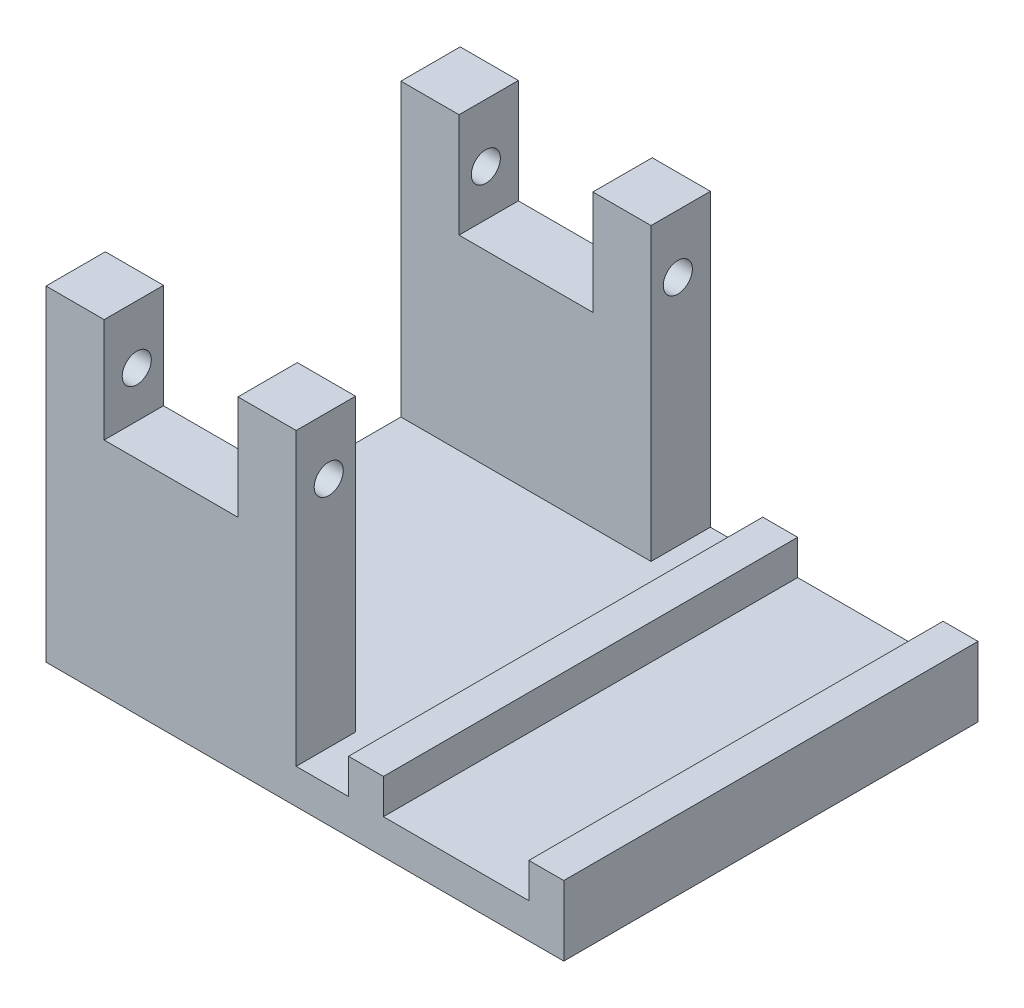
ISO-10303-21;
HEADER;
FILE_DESCRIPTION(('STEP AP214'),'2;1');
FILE_NAME('part.step','',(''),(''),'','','');
FILE_SCHEMA(('AUTOMOTIVE_DESIGN { 1 0 10303 214 1 1 1 1 }'));
ENDSEC;
DATA;
#1=APPLICATION_CONTEXT('core data for automotive mechanical design processes');
#2=APPLICATION_PROTOCOL_DEFINITION('international standard','automotive_design',2000,#1);
#3=PRODUCT_CONTEXT('',#1,'mechanical');
#4=PRODUCT('Part','Part','',(#3));
#5=PRODUCT_RELATED_PRODUCT_CATEGORY('part','',(#4));
#6=PRODUCT_DEFINITION_FORMATION('','',#4);
#7=PRODUCT_DEFINITION_CONTEXT('part definition',#1,'design');
#8=PRODUCT_DEFINITION('design','',#6,#7);
#9=PRODUCT_DEFINITION_SHAPE('','',#8);
#10=(LENGTH_UNIT() NAMED_UNIT(*) SI_UNIT(.MILLI.,.METRE.));
#11=(NAMED_UNIT(*) PLANE_ANGLE_UNIT() SI_UNIT($,.RADIAN.));
#12=(NAMED_UNIT(*) SI_UNIT($,.STERADIAN.) SOLID_ANGLE_UNIT());
#13=UNCERTAINTY_MEASURE_WITH_UNIT(LENGTH_MEASURE(1.E-05),#10,'distance_accuracy_value','');
#14=(GEOMETRIC_REPRESENTATION_CONTEXT(3) GLOBAL_UNCERTAINTY_ASSIGNED_CONTEXT((#13)) GLOBAL_UNIT_ASSIGNED_CONTEXT((#10,
#11,#12)) REPRESENTATION_CONTEXT('',''));
#15=CARTESIAN_POINT('',(0.,0.,0.));
#16=DIRECTION('',(0.,0.,1.));
#17=DIRECTION('',(1.,0.,0.));
#18=AXIS2_PLACEMENT_3D('',#15,#16,#17);
#19=CARTESIAN_POINT('',(0.,3.,0.));
#20=DIRECTION('',(0.,-1.,0.));
#21=DIRECTION('',(0.,0.,-1.));
#22=AXIS2_PLACEMENT_3D('',#19,#20,#21);
#23=PLANE('',#22);
#24=DIRECTION('',(1.,0.,0.));
#25=VECTOR('',#24,1.);
#26=CARTESIAN_POINT('',(-10.75,3.,-12.7));
#27=LINE('',#26,#25);
#28=CARTESIAN_POINT('',(-10.75,3.,-12.7));
#29=VERTEX_POINT('',#28);
#30=CARTESIAN_POINT('',(10.75,3.,-12.7));
#31=VERTEX_POINT('',#30);
#32=EDGE_CURVE('E318',#29,#31,#27,.T.);
#33=ORIENTED_EDGE('',*,*,#32,.F.);
#34=DIRECTION('',(0.,0.,1.));
#35=VECTOR('',#34,1.);
#36=CARTESIAN_POINT('',(-10.75,3.,0.));
#37=LINE('',#36,#35);
#38=CARTESIAN_POINT('',(-10.75,3.,12.7));
#39=VERTEX_POINT('',#38);
#40=EDGE_CURVE('E229',#29,#39,#37,.T.);
#41=ORIENTED_EDGE('',*,*,#40,.T.);
#42=DIRECTION('',(-1.,0.,0.));
#43=VECTOR('',#42,1.);
#44=CARTESIAN_POINT('',(-10.75,3.,12.7));
#45=LINE('',#44,#43);
#46=CARTESIAN_POINT('',(10.75,3.,12.7));
#47=VERTEX_POINT('',#46);
#48=EDGE_CURVE('E309',#47,#39,#45,.T.);
#49=ORIENTED_EDGE('',*,*,#48,.F.);
#50=DIRECTION('',(0.,0.,-1.));
#51=VECTOR('',#50,1.);
#52=CARTESIAN_POINT('',(10.75,3.,17.8));
#53=LINE('',#52,#51);
#54=CARTESIAN_POINT('',(10.75,3.,17.8));
#55=VERTEX_POINT('',#54);
#56=EDGE_CURVE('E313',#55,#47,#53,.T.);
#57=ORIENTED_EDGE('',*,*,#56,.F.);
#58=DIRECTION('',(-1.,0.,0.));
#59=VECTOR('',#58,1.);
#60=CARTESIAN_POINT('',(30.75,3.,17.8));
#61=LINE('',#60,#59);
#62=CARTESIAN_POINT('',(15.25,3.,17.8));
#63=VERTEX_POINT('',#62);
#64=EDGE_CURVE('E404',#63,#55,#61,.T.);
#65=ORIENTED_EDGE('',*,*,#64,.F.);
#66=DIRECTION('',(0.,0.,1.));
#67=VECTOR('',#66,1.);
#68=CARTESIAN_POINT('',(15.25,3.,-17.8));
#69=LINE('',#68,#67);
#70=CARTESIAN_POINT('',(15.25,3.,-17.8));
#71=VERTEX_POINT('',#70);
#72=EDGE_CURVE('E69',#71,#63,#69,.T.);
#73=ORIENTED_EDGE('',*,*,#72,.F.);
#74=DIRECTION('',(-1.,0.,0.));
#75=VECTOR('',#74,1.);
#76=CARTESIAN_POINT('',(-18.25,3.,-17.8));
#77=LINE('',#76,#75);
#78=CARTESIAN_POINT('',(10.75,3.,-17.8));
#79=VERTEX_POINT('',#78);
#80=EDGE_CURVE('E236',#71,#79,#77,.T.);
#81=ORIENTED_EDGE('',*,*,#80,.T.);
#82=DIRECTION('',(0.,0.,-1.));
#83=VECTOR('',#82,1.);
#84=CARTESIAN_POINT('',(10.75,3.,-17.8));
#85=LINE('',#84,#83);
#86=EDGE_CURVE('E336',#31,#79,#85,.T.);
#87=ORIENTED_EDGE('',*,*,#86,.F.);
#88=EDGE_LOOP('',(#33,#41,#49,#57,#65,#73,#81,#87));
#89=FACE_BOUND('',#88,.T.);
#90=ADVANCED_FACE('F45',(#89),#23,.F.);
#91=DIRECTION('',(0.,0.,-1.));
#92=VECTOR('',#91,1.);
#93=CARTESIAN_POINT('',(18.25,3.,-17.8));
#94=LINE('',#93,#92);
#95=CARTESIAN_POINT('',(18.25,3.,17.8));
#96=VERTEX_POINT('',#95);
#97=CARTESIAN_POINT('',(18.25,3.,-17.8));
#98=VERTEX_POINT('',#97);
#99=EDGE_CURVE('E414',#96,#98,#94,.T.);
#100=ORIENTED_EDGE('',*,*,#99,.F.);
#101=CARTESIAN_POINT('',(30.75,3.,17.8));
#102=VERTEX_POINT('',#101);
#103=EDGE_CURVE('E242',#102,#96,#61,.T.);
#104=ORIENTED_EDGE('',*,*,#103,.F.);
#105=DIRECTION('',(0.,0.,1.));
#106=VECTOR('',#105,1.);
#107=CARTESIAN_POINT('',(30.75,3.,17.8));
#108=LINE('',#107,#106);
#109=CARTESIAN_POINT('',(30.75,3.,-17.8));
#110=VERTEX_POINT('',#109);
#111=EDGE_CURVE('E390',#110,#102,#108,.T.);
#112=ORIENTED_EDGE('',*,*,#111,.F.);
#113=EDGE_CURVE('E54',#110,#98,#77,.T.);
#114=ORIENTED_EDGE('',*,*,#113,.T.);
#115=EDGE_LOOP('',(#100,#104,#112,#114));
#116=FACE_BOUND('',#115,.T.);
#117=ADVANCED_FACE('F412',(#116),#23,.F.);
#118=CARTESIAN_POINT('',(0.,28.,0.));
#119=DIRECTION('',(0.,1.,0.));
#120=DIRECTION('',(0.,0.,1.));
#121=AXIS2_PLACEMENT_3D('',#118,#119,#120);
#122=PLANE('',#121);
#123=DIRECTION('',(0.,0.,-1.));
#124=VECTOR('',#123,1.);
#125=CARTESIAN_POINT('',(5.75,28.,17.8));
#126=LINE('',#125,#124);
#127=CARTESIAN_POINT('',(5.75,28.,-12.7));
#128=VERTEX_POINT('',#127);
#129=CARTESIAN_POINT('',(5.75,28.,-17.8));
#130=VERTEX_POINT('',#129);
#131=EDGE_CURVE('E478',#128,#130,#126,.T.);
#132=ORIENTED_EDGE('',*,*,#131,.F.);
#133=DIRECTION('',(1.,0.,0.));
#134=VECTOR('',#133,1.);
#135=CARTESIAN_POINT('',(-10.75,28.,-12.7));
#136=LINE('',#135,#134);
#137=CARTESIAN_POINT('',(10.75,28.,-12.7));
#138=VERTEX_POINT('',#137);
#139=EDGE_CURVE('E335',#128,#138,#136,.T.);
#140=ORIENTED_EDGE('',*,*,#139,.T.);
#141=DIRECTION('',(0.,0.,-1.));
#142=VECTOR('',#141,1.);
#143=CARTESIAN_POINT('',(10.75,28.,-17.8));
#144=LINE('',#143,#142);
#145=CARTESIAN_POINT('',(10.75,28.,-17.8));
#146=VERTEX_POINT('',#145);
#147=EDGE_CURVE('E340',#138,#146,#144,.T.);
#148=ORIENTED_EDGE('',*,*,#147,.T.);
#149=DIRECTION('',(-1.,0.,0.));
#150=VECTOR('',#149,1.);
#151=CARTESIAN_POINT('',(-10.75,28.,-17.8));
#152=LINE('',#151,#150);
#153=EDGE_CURVE('E344',#146,#130,#152,.T.);
#154=ORIENTED_EDGE('',*,*,#153,.T.);
#155=EDGE_LOOP('',(#132,#140,#148,#154));
#156=FACE_BOUND('',#155,.T.);
#157=ADVANCED_FACE('F557',(#156),#122,.T.);
#158=CARTESIAN_POINT('',(0.,28.,0.));
#159=DIRECTION('',(0.,-1.,0.));
#160=DIRECTION('',(0.,0.,-1.));
#161=AXIS2_PLACEMENT_3D('',#158,#159,#160);
#162=PLANE('',#161);
#163=DIRECTION('',(-1.,0.,0.));
#164=VECTOR('',#163,1.);
#165=CARTESIAN_POINT('',(-10.75,28.,12.7));
#166=LINE('',#165,#164);
#167=CARTESIAN_POINT('',(10.75,28.,12.7));
#168=VERTEX_POINT('',#167);
#169=CARTESIAN_POINT('',(5.75,28.,12.7));
#170=VERTEX_POINT('',#169);
#171=EDGE_CURVE('E319',#168,#170,#166,.T.);
#172=ORIENTED_EDGE('',*,*,#171,.T.);
#173=CARTESIAN_POINT('',(5.75,28.,17.8));
#174=VERTEX_POINT('',#173);
#175=EDGE_CURVE('E249',#174,#170,#126,.T.);
#176=ORIENTED_EDGE('',*,*,#175,.F.);
#177=DIRECTION('',(1.,0.,0.));
#178=VECTOR('',#177,1.);
#179=CARTESIAN_POINT('',(-10.75,28.,17.8));
#180=LINE('',#179,#178);
#181=CARTESIAN_POINT('',(10.75,28.,17.8));
#182=VERTEX_POINT('',#181);
#183=EDGE_CURVE('E326',#174,#182,#180,.T.);
#184=ORIENTED_EDGE('',*,*,#183,.T.);
#185=DIRECTION('',(0.,0.,-1.));
#186=VECTOR('',#185,1.);
#187=CARTESIAN_POINT('',(10.75,28.,17.8));
#188=LINE('',#187,#186);
#189=EDGE_CURVE('E323',#182,#168,#188,.T.);
#190=ORIENTED_EDGE('',*,*,#189,.T.);
#191=EDGE_LOOP('',(#172,#176,#184,#190));
#192=FACE_BOUND('',#191,.T.);
#193=ADVANCED_FACE('F535',(#192),#162,.F.);
#194=CARTESIAN_POINT('',(-33.75,23.,15.));
#195=DIRECTION('',(1.,0.,0.));
#196=DIRECTION('',(0.,0.,-1.));
#197=AXIS2_PLACEMENT_3D('',#194,#195,#196);
#198=CYLINDRICAL_SURFACE('',#197,1.25);
#199=CARTESIAN_POINT('',(5.75,23.,15.));
#200=DIRECTION('',(1.,0.,0.));
#201=DIRECTION('',(0.,1.,0.));
#202=AXIS2_PLACEMENT_3D('',#199,#200,#201);
#203=CIRCLE('',#202,1.25);
#204=CARTESIAN_POINT('',(5.75,24.25,15.));
#205=VERTEX_POINT('',#204);
#206=EDGE_CURVE('E253',#205,#205,#203,.F.);
#207=ORIENTED_EDGE('',*,*,#206,.T.);
#208=EDGE_LOOP('',(#207));
#209=FACE_BOUND('',#208,.T.);
#210=CARTESIAN_POINT('',(10.75,23.,15.));
#211=DIRECTION('',(1.,0.,0.));
#212=DIRECTION('',(0.,0.,1.));
#213=AXIS2_PLACEMENT_3D('',#210,#211,#212);
#214=CIRCLE('',#213,1.25);
#215=CARTESIAN_POINT('',(10.75,23.,16.25));
#216=VERTEX_POINT('',#215);
#217=EDGE_CURVE('E283',#216,#216,#214,.T.);
#218=ORIENTED_EDGE('',*,*,#217,.T.);
#219=EDGE_LOOP('',(#218));
#220=FACE_BOUND('',#219,.T.);
#221=ADVANCED_FACE('F570',(#209,#220),#198,.F.);
#222=CARTESIAN_POINT('',(-33.75,23.,-15.));
#223=DIRECTION('',(1.,0.,0.));
#224=DIRECTION('',(0.,0.,-1.));
#225=AXIS2_PLACEMENT_3D('',#222,#223,#224);
#226=CYLINDRICAL_SURFACE('',#225,1.25);
#227=CARTESIAN_POINT('',(5.75,23.,-15.));
#228=DIRECTION('',(1.,0.,0.));
#229=DIRECTION('',(0.,1.,0.));
#230=AXIS2_PLACEMENT_3D('',#227,#228,#229);
#231=CIRCLE('',#230,1.25);
#232=CARTESIAN_POINT('',(5.75,24.25,-15.));
#233=VERTEX_POINT('',#232);
#234=EDGE_CURVE('E250',#233,#233,#231,.F.);
#235=ORIENTED_EDGE('',*,*,#234,.T.);
#236=EDGE_LOOP('',(#235));
#237=FACE_BOUND('',#236,.T.);
#238=CARTESIAN_POINT('',(10.75,23.,-15.));
#239=DIRECTION('',(1.,0.,0.));
#240=DIRECTION('',(0.,0.,-1.));
#241=AXIS2_PLACEMENT_3D('',#238,#239,#240);
#242=CIRCLE('',#241,1.25);
#243=CARTESIAN_POINT('',(10.75,23.,-16.25));
#244=VERTEX_POINT('',#243);
#245=EDGE_CURVE('E284',#244,#244,#242,.T.);
#246=ORIENTED_EDGE('',*,*,#245,.T.);
#247=EDGE_LOOP('',(#246));
#248=FACE_BOUND('',#247,.T.);
#249=ADVANCED_FACE('F566',(#237,#248),#226,.F.);
#250=CARTESIAN_POINT('',(-18.25,3.,-17.8));
#251=DIRECTION('',(0.,0.,1.));
#252=DIRECTION('',(1.,0.,0.));
#253=AXIS2_PLACEMENT_3D('',#250,#251,#252);
#254=PLANE('',#253);
#255=DIRECTION('',(-1.,0.,0.));
#256=VECTOR('',#255,1.);
#257=CARTESIAN_POINT('',(-18.25,0.,-17.8));
#258=LINE('',#257,#256);
#259=CARTESIAN_POINT('',(33.75,0.,-17.8));
#260=VERTEX_POINT('',#259);
#261=CARTESIAN_POINT('',(-10.75,0.,-17.8));
#262=VERTEX_POINT('',#261);
#263=EDGE_CURVE('E237',#260,#262,#258,.T.);
#264=ORIENTED_EDGE('',*,*,#263,.T.);
#265=DIRECTION('',(0.,-1.,0.));
#266=VECTOR('',#265,1.);
#267=CARTESIAN_POINT('',(-10.75,28.,-17.8));
#268=LINE('',#267,#266);
#269=CARTESIAN_POINT('',(-10.75,28.,-17.8));
#270=VERTEX_POINT('',#269);
#271=EDGE_CURVE('E61',#270,#262,#268,.T.);
#272=ORIENTED_EDGE('',*,*,#271,.F.);
#273=CARTESIAN_POINT('',(-5.75000000000001,28.,-17.8));
#274=VERTEX_POINT('',#273);
#275=EDGE_CURVE('E343',#274,#270,#152,.T.);
#276=ORIENTED_EDGE('',*,*,#275,.F.);
#277=DIRECTION('',(0.,1.,0.));
#278=VECTOR('',#277,1.);
#279=CARTESIAN_POINT('',(-5.75000000000001,28.,-17.8));
#280=LINE('',#279,#278);
#281=CARTESIAN_POINT('',(-5.75000000000001,19.0369423083039,-17.8));
#282=VERTEX_POINT('',#281);
#283=EDGE_CURVE('E458',#282,#274,#280,.T.);
#284=ORIENTED_EDGE('',*,*,#283,.F.);
#285=DIRECTION('',(-1.,0.,0.));
#286=VECTOR('',#285,1.);
#287=CARTESIAN_POINT('',(5.75,19.0369423083039,-17.8));
#288=LINE('',#287,#286);
#289=CARTESIAN_POINT('',(5.75,19.0369423083039,-17.8));
#290=VERTEX_POINT('',#289);
#291=EDGE_CURVE('E470',#290,#282,#288,.T.);
#292=ORIENTED_EDGE('',*,*,#291,.F.);
#293=DIRECTION('',(0.,-1.,0.));
#294=VECTOR('',#293,1.);
#295=CARTESIAN_POINT('',(5.75,28.,-17.8));
#296=LINE('',#295,#294);
#297=EDGE_CURVE('E466',#130,#290,#296,.T.);
#298=ORIENTED_EDGE('',*,*,#297,.F.);
#299=ORIENTED_EDGE('',*,*,#153,.F.);
#300=DIRECTION('',(0.,-1.,0.));
#301=VECTOR('',#300,1.);
#302=CARTESIAN_POINT('',(10.75,28.,-17.8));
#303=LINE('',#302,#301);
#304=EDGE_CURVE('E356',#146,#79,#303,.T.);
#305=ORIENTED_EDGE('',*,*,#304,.T.);
#306=ORIENTED_EDGE('',*,*,#80,.F.);
#307=DIRECTION('',(0.,-1.,0.));
#308=VECTOR('',#307,1.);
#309=CARTESIAN_POINT('',(15.25,41.7261808762146,-17.8));
#310=LINE('',#309,#308);
#311=CARTESIAN_POINT('',(15.25,6.,-17.8));
#312=VERTEX_POINT('',#311);
#313=EDGE_CURVE('E426',#312,#71,#310,.T.);
#314=ORIENTED_EDGE('',*,*,#313,.F.);
#315=DIRECTION('',(1.,0.,0.));
#316=VECTOR('',#315,1.);
#317=CARTESIAN_POINT('',(18.25,6.,-17.8));
#318=LINE('',#317,#316);
#319=CARTESIAN_POINT('',(18.25,6.,-17.8));
#320=VERTEX_POINT('',#319);
#321=EDGE_CURVE('E421',#312,#320,#318,.T.);
#322=ORIENTED_EDGE('',*,*,#321,.T.);
#323=DIRECTION('',(0.,-1.,0.));
#324=VECTOR('',#323,1.);
#325=CARTESIAN_POINT('',(18.25,41.7261808762146,-17.8));
#326=LINE('',#325,#324);
#327=EDGE_CURVE('E419',#320,#98,#326,.T.);
#328=ORIENTED_EDGE('',*,*,#327,.T.);
#329=ORIENTED_EDGE('',*,*,#113,.F.);
#330=DIRECTION('',(0.,-1.,0.));
#331=VECTOR('',#330,1.);
#332=CARTESIAN_POINT('',(30.75,6.,-17.8));
#333=LINE('',#332,#331);
#334=CARTESIAN_POINT('',(30.75,6.,-17.8));
#335=VERTEX_POINT('',#334);
#336=EDGE_CURVE('E383',#335,#110,#333,.T.);
#337=ORIENTED_EDGE('',*,*,#336,.F.);
#338=DIRECTION('',(1.,0.,0.));
#339=VECTOR('',#338,1.);
#340=CARTESIAN_POINT('',(30.75,6.,-17.8));
#341=LINE('',#340,#339);
#342=CARTESIAN_POINT('',(33.75,6.,-17.8));
#343=VERTEX_POINT('',#342);
#344=EDGE_CURVE('E371',#335,#343,#341,.T.);
#345=ORIENTED_EDGE('',*,*,#344,.T.);
#346=DIRECTION('',(0.,-1.,0.));
#347=VECTOR('',#346,1.);
#348=CARTESIAN_POINT('',(33.75,6.,-17.8));
#349=LINE('',#348,#347);
#350=EDGE_CURVE('E394',#343,#260,#349,.T.);
#351=ORIENTED_EDGE('',*,*,#350,.T.);
#352=EDGE_LOOP('',(#264,#272,#276,#284,#292,#298,#299,#305,#306,#314,#322,#328,#329,#337,#345,#351));
#353=FACE_BOUND('',#352,.T.);
#354=ADVANCED_FACE('F47',(#353),#254,.F.);
#355=CARTESIAN_POINT('',(-18.25,3.,17.8));
#356=DIRECTION('',(0.,0.,-1.));
#357=DIRECTION('',(-1.,0.,0.));
#358=AXIS2_PLACEMENT_3D('',#355,#356,#357);
#359=PLANE('',#358);
#360=DIRECTION('',(0.,-1.,0.));
#361=VECTOR('',#360,1.);
#362=CARTESIAN_POINT('',(-10.75,28.,17.8));
#363=LINE('',#362,#361);
#364=CARTESIAN_POINT('',(-10.75,28.,17.8));
#365=VERTEX_POINT('',#364);
#366=CARTESIAN_POINT('',(-10.75,0.,17.8));
#367=VERTEX_POINT('',#366);
#368=EDGE_CURVE('E209',#365,#367,#363,.T.);
#369=ORIENTED_EDGE('',*,*,#368,.T.);
#370=DIRECTION('',(1.,0.,0.));
#371=VECTOR('',#370,1.);
#372=CARTESIAN_POINT('',(-18.25,0.,17.8));
#373=LINE('',#372,#371);
#374=CARTESIAN_POINT('',(33.75,0.,17.8));
#375=VERTEX_POINT('',#374);
#376=EDGE_CURVE('E212',#367,#375,#373,.T.);
#377=ORIENTED_EDGE('',*,*,#376,.T.);
#378=DIRECTION('',(0.,-1.,0.));
#379=VECTOR('',#378,1.);
#380=CARTESIAN_POINT('',(33.75,6.,17.8));
#381=LINE('',#380,#379);
#382=CARTESIAN_POINT('',(33.75,6.,17.8));
#383=VERTEX_POINT('',#382);
#384=EDGE_CURVE('E391',#383,#375,#381,.T.);
#385=ORIENTED_EDGE('',*,*,#384,.F.);
#386=DIRECTION('',(-1.,0.,0.));
#387=VECTOR('',#386,1.);
#388=CARTESIAN_POINT('',(30.75,6.,17.8));
#389=LINE('',#388,#387);
#390=CARTESIAN_POINT('',(30.75,6.,17.8));
#391=VERTEX_POINT('',#390);
#392=EDGE_CURVE('E379',#383,#391,#389,.T.);
#393=ORIENTED_EDGE('',*,*,#392,.T.);
#394=DIRECTION('',(0.,-1.,0.));
#395=VECTOR('',#394,1.);
#396=CARTESIAN_POINT('',(30.75,6.,17.8));
#397=LINE('',#396,#395);
#398=EDGE_CURVE('E386',#391,#102,#397,.T.);
#399=ORIENTED_EDGE('',*,*,#398,.T.);
#400=ORIENTED_EDGE('',*,*,#103,.T.);
#401=DIRECTION('',(0.,-1.,0.));
#402=VECTOR('',#401,1.);
#403=CARTESIAN_POINT('',(18.25,41.7261808762146,17.8));
#404=LINE('',#403,#402);
#405=CARTESIAN_POINT('',(18.25,6.,17.8));
#406=VERTEX_POINT('',#405);
#407=EDGE_CURVE('E430',#406,#96,#404,.T.);
#408=ORIENTED_EDGE('',*,*,#407,.F.);
#409=DIRECTION('',(-1.,0.,0.));
#410=VECTOR('',#409,1.);
#411=CARTESIAN_POINT('',(18.25,6.,17.8));
#412=LINE('',#411,#410);
#413=CARTESIAN_POINT('',(15.25,6.,17.8));
#414=VERTEX_POINT('',#413);
#415=EDGE_CURVE('E425',#406,#414,#412,.T.);
#416=ORIENTED_EDGE('',*,*,#415,.T.);
#417=DIRECTION('',(0.,-1.,0.));
#418=VECTOR('',#417,1.);
#419=CARTESIAN_POINT('',(15.25,41.7261808762146,17.8));
#420=LINE('',#419,#418);
#421=EDGE_CURVE('E444',#414,#63,#420,.T.);
#422=ORIENTED_EDGE('',*,*,#421,.T.);
#423=ORIENTED_EDGE('',*,*,#64,.T.);
#424=DIRECTION('',(0.,-1.,0.));
#425=VECTOR('',#424,1.);
#426=CARTESIAN_POINT('',(10.75,28.,17.8));
#427=LINE('',#426,#425);
#428=EDGE_CURVE('E220',#182,#55,#427,.T.);
#429=ORIENTED_EDGE('',*,*,#428,.F.);
#430=ORIENTED_EDGE('',*,*,#183,.F.);
#431=DIRECTION('',(0.,-1.,0.));
#432=VECTOR('',#431,1.);
#433=CARTESIAN_POINT('',(5.75,28.,17.8));
#434=LINE('',#433,#432);
#435=CARTESIAN_POINT('',(5.75,19.0369423083039,17.8));
#436=VERTEX_POINT('',#435);
#437=EDGE_CURVE('E453',#174,#436,#434,.T.);
#438=ORIENTED_EDGE('',*,*,#437,.T.);
#439=DIRECTION('',(-1.,0.,0.));
#440=VECTOR('',#439,1.);
#441=CARTESIAN_POINT('',(5.75,19.0369423083039,17.8));
#442=LINE('',#441,#440);
#443=CARTESIAN_POINT('',(-5.75000000000001,19.0369423083039,17.8));
#444=VERTEX_POINT('',#443);
#445=EDGE_CURVE('E457',#436,#444,#442,.T.);
#446=ORIENTED_EDGE('',*,*,#445,.T.);
#447=DIRECTION('',(0.,1.,0.));
#448=VECTOR('',#447,1.);
#449=CARTESIAN_POINT('',(-5.75000000000001,28.,17.8));
#450=LINE('',#449,#448);
#451=CARTESIAN_POINT('',(-5.75000000000001,28.,17.8));
#452=VERTEX_POINT('',#451);
#453=EDGE_CURVE('E462',#444,#452,#450,.T.);
#454=ORIENTED_EDGE('',*,*,#453,.T.);
#455=EDGE_CURVE('E216',#365,#452,#180,.T.);
#456=ORIENTED_EDGE('',*,*,#455,.F.);
#457=EDGE_LOOP('',(#369,#377,#385,#393,#399,#400,#408,#416,#422,#423,#429,#430,#438,#446,#454,#456));
#458=FACE_BOUND('',#457,.T.);
#459=ADVANCED_FACE('F210',(#458),#359,.F.);
#460=CARTESIAN_POINT('',(0.,0.,0.));
#461=DIRECTION('',(0.,-1.,0.));
#462=DIRECTION('',(0.,0.,-1.));
#463=AXIS2_PLACEMENT_3D('',#460,#461,#462);
#464=PLANE('',#463);
#465=DIRECTION('',(0.,0.,-1.));
#466=VECTOR('',#465,1.);
#467=CARTESIAN_POINT('',(-10.75,0.,-17.8));
#468=LINE('',#467,#466);
#469=EDGE_CURVE('E223',#367,#262,#468,.T.);
#470=ORIENTED_EDGE('',*,*,#469,.T.);
#471=ORIENTED_EDGE('',*,*,#263,.F.);
#472=DIRECTION('',(0.,0.,1.));
#473=VECTOR('',#472,1.);
#474=CARTESIAN_POINT('',(33.75,0.,17.8));
#475=LINE('',#474,#473);
#476=EDGE_CURVE('E234',#260,#375,#475,.T.);
#477=ORIENTED_EDGE('',*,*,#476,.T.);
#478=ORIENTED_EDGE('',*,*,#376,.F.);
#479=EDGE_LOOP('',(#470,#471,#477,#478));
#480=FACE_BOUND('',#479,.T.);
#481=ADVANCED_FACE('F232',(#480),#464,.T.);
#482=CARTESIAN_POINT('',(30.75,6.,17.8));
#483=DIRECTION('',(-1.,0.,0.));
#484=DIRECTION('',(0.,0.,1.));
#485=AXIS2_PLACEMENT_3D('',#482,#483,#484);
#486=PLANE('',#485);
#487=ORIENTED_EDGE('',*,*,#336,.T.);
#488=ORIENTED_EDGE('',*,*,#111,.T.);
#489=ORIENTED_EDGE('',*,*,#398,.F.);
#490=DIRECTION('',(0.,0.,-1.));
#491=VECTOR('',#490,1.);
#492=CARTESIAN_POINT('',(30.75,6.,17.8));
#493=LINE('',#492,#491);
#494=EDGE_CURVE('E367',#391,#335,#493,.T.);
#495=ORIENTED_EDGE('',*,*,#494,.T.);
#496=EDGE_LOOP('',(#487,#488,#489,#495));
#497=FACE_BOUND('',#496,.T.);
#498=ADVANCED_FACE('F560',(#497),#486,.T.);
#499=CARTESIAN_POINT('',(33.75,6.,17.8));
#500=DIRECTION('',(1.,0.,0.));
#501=DIRECTION('',(0.,0.,-1.));
#502=AXIS2_PLACEMENT_3D('',#499,#500,#501);
#503=PLANE('',#502);
#504=ORIENTED_EDGE('',*,*,#476,.F.);
#505=ORIENTED_EDGE('',*,*,#350,.F.);
#506=DIRECTION('',(0.,0.,1.));
#507=VECTOR('',#506,1.);
#508=CARTESIAN_POINT('',(33.75,6.,17.8));
#509=LINE('',#508,#507);
#510=EDGE_CURVE('E375',#343,#383,#509,.T.);
#511=ORIENTED_EDGE('',*,*,#510,.T.);
#512=ORIENTED_EDGE('',*,*,#384,.T.);
#513=EDGE_LOOP('',(#504,#505,#511,#512));
#514=FACE_BOUND('',#513,.T.);
#515=ADVANCED_FACE('F601',(#514),#503,.T.);
#516=CARTESIAN_POINT('',(0.,6.,0.));
#517=DIRECTION('',(0.,-1.,0.));
#518=DIRECTION('',(0.,0.,-1.));
#519=AXIS2_PLACEMENT_3D('',#516,#517,#518);
#520=PLANE('',#519);
#521=ORIENTED_EDGE('',*,*,#494,.F.);
#522=ORIENTED_EDGE('',*,*,#392,.F.);
#523=ORIENTED_EDGE('',*,*,#510,.F.);
#524=ORIENTED_EDGE('',*,*,#344,.F.);
#525=EDGE_LOOP('',(#521,#522,#523,#524));
#526=FACE_BOUND('',#525,.T.);
#527=ADVANCED_FACE('F593',(#526),#520,.F.);
#528=CARTESIAN_POINT('',(-10.75,28.,-17.8));
#529=DIRECTION('',(1.,0.,0.));
#530=DIRECTION('',(0.,0.,-1.));
#531=AXIS2_PLACEMENT_3D('',#528,#529,#530);
#532=PLANE('',#531);
#533=CARTESIAN_POINT('',(-10.75,23.,-15.));
#534=DIRECTION('',(1.,0.,0.));
#535=DIRECTION('',(0.,0.,-1.));
#536=AXIS2_PLACEMENT_3D('',#533,#534,#535);
#537=CIRCLE('',#536,1.25);
#538=CARTESIAN_POINT('',(-10.75,23.,-16.25));
#539=VERTEX_POINT('',#538);
#540=EDGE_CURVE('E221',#539,#539,#537,.T.);
#541=ORIENTED_EDGE('',*,*,#540,.T.);
#542=EDGE_LOOP('',(#541));
#543=FACE_BOUND('',#542,.T.);
#544=ORIENTED_EDGE('',*,*,#271,.T.);
#545=ORIENTED_EDGE('',*,*,#469,.F.);
#546=ORIENTED_EDGE('',*,*,#368,.F.);
#547=DIRECTION('',(0.,0.,1.));
#548=VECTOR('',#547,1.);
#549=CARTESIAN_POINT('',(-10.75,28.,17.8));
#550=LINE('',#549,#548);
#551=CARTESIAN_POINT('',(-10.75,28.,12.7));
#552=VERTEX_POINT('',#551);
#553=EDGE_CURVE('E314',#552,#365,#550,.T.);
#554=ORIENTED_EDGE('',*,*,#553,.F.);
#555=DIRECTION('',(0.,-1.,0.));
#556=VECTOR('',#555,1.);
#557=CARTESIAN_POINT('',(-10.75,28.,12.7));
#558=LINE('',#557,#556);
#559=EDGE_CURVE('E305',#552,#39,#558,.T.);
#560=ORIENTED_EDGE('',*,*,#559,.T.);
#561=ORIENTED_EDGE('',*,*,#40,.F.);
#562=DIRECTION('',(0.,-1.,0.));
#563=VECTOR('',#562,1.);
#564=CARTESIAN_POINT('',(-10.75,28.,-12.7));
#565=LINE('',#564,#563);
#566=CARTESIAN_POINT('',(-10.75,28.,-12.7));
#567=VERTEX_POINT('',#566);
#568=EDGE_CURVE('E364',#567,#29,#565,.T.);
#569=ORIENTED_EDGE('',*,*,#568,.F.);
#570=DIRECTION('',(0.,0.,1.));
#571=VECTOR('',#570,1.);
#572=CARTESIAN_POINT('',(-10.75,28.,-17.8));
#573=LINE('',#572,#571);
#574=EDGE_CURVE('E331',#270,#567,#573,.T.);
#575=ORIENTED_EDGE('',*,*,#574,.F.);
#576=EDGE_LOOP('',(#544,#545,#546,#554,#560,#561,#569,#575));
#577=FACE_BOUND('',#576,.T.);
#578=CARTESIAN_POINT('',(-10.75,23.,15.));
#579=DIRECTION('',(1.,0.,0.));
#580=DIRECTION('',(0.,0.,-1.));
#581=AXIS2_PLACEMENT_3D('',#578,#579,#580);
#582=CIRCLE('',#581,1.25);
#583=CARTESIAN_POINT('',(-10.75,23.,13.75));
#584=VERTEX_POINT('',#583);
#585=EDGE_CURVE('E288',#584,#584,#582,.T.);
#586=ORIENTED_EDGE('',*,*,#585,.T.);
#587=EDGE_LOOP('',(#586));
#588=FACE_BOUND('',#587,.T.);
#589=ADVANCED_FACE('F224',(#543,#577,#588),#532,.F.);
#590=CARTESIAN_POINT('',(-10.75,28.,-12.7));
#591=DIRECTION('',(0.,0.,-1.));
#592=DIRECTION('',(-1.,0.,0.));
#593=AXIS2_PLACEMENT_3D('',#590,#591,#592);
#594=PLANE('',#593);
#595=ORIENTED_EDGE('',*,*,#139,.F.);
#596=DIRECTION('',(0.,-1.,0.));
#597=VECTOR('',#596,1.);
#598=CARTESIAN_POINT('',(5.75,28.,-12.7));
#599=LINE('',#598,#597);
#600=CARTESIAN_POINT('',(5.75,19.0369423083039,-12.7));
#601=VERTEX_POINT('',#600);
#602=EDGE_CURVE('E276',#128,#601,#599,.T.);
#603=ORIENTED_EDGE('',*,*,#602,.T.);
#604=DIRECTION('',(-1.,0.,0.));
#605=VECTOR('',#604,1.);
#606=CARTESIAN_POINT('',(-10.75,19.0369423083039,-12.7));
#607=LINE('',#606,#605);
#608=CARTESIAN_POINT('',(-5.75000000000001,19.0369423083039,-12.7));
#609=VERTEX_POINT('',#608);
#610=EDGE_CURVE('E280',#601,#609,#607,.T.);
#611=ORIENTED_EDGE('',*,*,#610,.T.);
#612=DIRECTION('',(0.,1.,0.));
#613=VECTOR('',#612,1.);
#614=CARTESIAN_POINT('',(-5.75000000000001,28.,-12.7));
#615=LINE('',#614,#613);
#616=CARTESIAN_POINT('',(-5.75000000000001,28.,-12.7));
#617=VERTEX_POINT('',#616);
#618=EDGE_CURVE('E254',#609,#617,#615,.T.);
#619=ORIENTED_EDGE('',*,*,#618,.T.);
#620=EDGE_CURVE('E337',#567,#617,#136,.T.);
#621=ORIENTED_EDGE('',*,*,#620,.F.);
#622=ORIENTED_EDGE('',*,*,#568,.T.);
#623=ORIENTED_EDGE('',*,*,#32,.T.);
#624=DIRECTION('',(0.,-1.,0.));
#625=VECTOR('',#624,1.);
#626=CARTESIAN_POINT('',(10.75,28.,-12.7));
#627=LINE('',#626,#625);
#628=EDGE_CURVE('E360',#138,#31,#627,.T.);
#629=ORIENTED_EDGE('',*,*,#628,.F.);
#630=EDGE_LOOP('',(#595,#603,#611,#619,#621,#622,#623,#629));
#631=FACE_BOUND('',#630,.T.);
#632=ADVANCED_FACE('F592',(#631),#594,.F.);
#633=CARTESIAN_POINT('',(10.75,28.,-17.8));
#634=DIRECTION('',(-1.,0.,0.));
#635=DIRECTION('',(0.,0.,1.));
#636=AXIS2_PLACEMENT_3D('',#633,#634,#635);
#637=PLANE('',#636);
#638=ORIENTED_EDGE('',*,*,#245,.F.);
#639=EDGE_LOOP('',(#638));
#640=FACE_BOUND('',#639,.T.);
#641=ORIENTED_EDGE('',*,*,#86,.T.);
#642=ORIENTED_EDGE('',*,*,#304,.F.);
#643=ORIENTED_EDGE('',*,*,#147,.F.);
#644=ORIENTED_EDGE('',*,*,#628,.T.);
#645=EDGE_LOOP('',(#641,#642,#643,#644));
#646=FACE_BOUND('',#645,.T.);
#647=ADVANCED_FACE('F598',(#640,#646),#637,.F.);
#648=DIRECTION('',(0.,0.,-1.));
#649=VECTOR('',#648,1.);
#650=CARTESIAN_POINT('',(-5.75000000000001,28.,17.8));
#651=LINE('',#650,#649);
#652=EDGE_CURVE('E483',#617,#274,#651,.T.);
#653=ORIENTED_EDGE('',*,*,#652,.T.);
#654=ORIENTED_EDGE('',*,*,#275,.T.);
#655=ORIENTED_EDGE('',*,*,#574,.T.);
#656=ORIENTED_EDGE('',*,*,#620,.T.);
#657=EDGE_LOOP('',(#653,#654,#655,#656));
#658=FACE_BOUND('',#657,.T.);
#659=ADVANCED_FACE('F618',(#658),#122,.T.);
#660=CARTESIAN_POINT('',(10.75,28.,17.8));
#661=DIRECTION('',(-1.,0.,0.));
#662=DIRECTION('',(0.,0.,1.));
#663=AXIS2_PLACEMENT_3D('',#660,#661,#662);
#664=PLANE('',#663);
#665=ORIENTED_EDGE('',*,*,#217,.F.);
#666=EDGE_LOOP('',(#665));
#667=FACE_BOUND('',#666,.T.);
#668=ORIENTED_EDGE('',*,*,#56,.T.);
#669=DIRECTION('',(0.,-1.,0.));
#670=VECTOR('',#669,1.);
#671=CARTESIAN_POINT('',(10.75,28.,12.7));
#672=LINE('',#671,#670);
#673=EDGE_CURVE('E301',#168,#47,#672,.T.);
#674=ORIENTED_EDGE('',*,*,#673,.F.);
#675=ORIENTED_EDGE('',*,*,#189,.F.);
#676=ORIENTED_EDGE('',*,*,#428,.T.);
#677=EDGE_LOOP('',(#668,#674,#675,#676));
#678=FACE_BOUND('',#677,.T.);
#679=ADVANCED_FACE('F523',(#667,#678),#664,.F.);
#680=CARTESIAN_POINT('',(-10.75,28.,12.7));
#681=DIRECTION('',(0.,0.,1.));
#682=DIRECTION('',(1.,0.,0.));
#683=AXIS2_PLACEMENT_3D('',#680,#681,#682);
#684=PLANE('',#683);
#685=DIRECTION('',(1.,0.,0.));
#686=VECTOR('',#685,1.);
#687=CARTESIAN_POINT('',(-10.75,19.0369423083039,12.7));
#688=LINE('',#687,#686);
#689=CARTESIAN_POINT('',(-5.75000000000001,19.0369423083039,12.7));
#690=VERTEX_POINT('',#689);
#691=CARTESIAN_POINT('',(5.75,19.0369423083039,12.7));
#692=VERTEX_POINT('',#691);
#693=EDGE_CURVE('E11',#690,#692,#688,.T.);
#694=ORIENTED_EDGE('',*,*,#693,.T.);
#695=DIRECTION('',(0.,1.,0.));
#696=VECTOR('',#695,1.);
#697=CARTESIAN_POINT('',(5.75,28.,12.7));
#698=LINE('',#697,#696);
#699=EDGE_CURVE('E260',#692,#170,#698,.T.);
#700=ORIENTED_EDGE('',*,*,#699,.T.);
#701=ORIENTED_EDGE('',*,*,#171,.F.);
#702=ORIENTED_EDGE('',*,*,#673,.T.);
#703=ORIENTED_EDGE('',*,*,#48,.T.);
#704=ORIENTED_EDGE('',*,*,#559,.F.);
#705=CARTESIAN_POINT('',(-5.75000000000001,28.,12.7));
#706=VERTEX_POINT('',#705);
#707=EDGE_CURVE('E308',#706,#552,#166,.T.);
#708=ORIENTED_EDGE('',*,*,#707,.F.);
#709=DIRECTION('',(0.,-1.,0.));
#710=VECTOR('',#709,1.);
#711=CARTESIAN_POINT('',(-5.75000000000001,28.,12.7));
#712=LINE('',#711,#710);
#713=EDGE_CURVE('E263',#706,#690,#712,.T.);
#714=ORIENTED_EDGE('',*,*,#713,.T.);
#715=EDGE_LOOP('',(#694,#700,#701,#702,#703,#704,#708,#714));
#716=FACE_BOUND('',#715,.T.);
#717=ADVANCED_FACE('F518',(#716),#684,.F.);
#718=ORIENTED_EDGE('',*,*,#455,.T.);
#719=EDGE_CURVE('E479',#452,#706,#651,.T.);
#720=ORIENTED_EDGE('',*,*,#719,.T.);
#721=ORIENTED_EDGE('',*,*,#707,.T.);
#722=ORIENTED_EDGE('',*,*,#553,.T.);
#723=EDGE_LOOP('',(#718,#720,#721,#722));
#724=FACE_BOUND('',#723,.T.);
#725=ADVANCED_FACE('F510',(#724),#162,.F.);
#726=CARTESIAN_POINT('',(-5.75000000000001,23.,15.));
#727=DIRECTION('',(-1.,0.,0.));
#728=DIRECTION('',(0.,-1.,0.));
#729=AXIS2_PLACEMENT_3D('',#726,#727,#728);
#730=CIRCLE('',#729,1.25);
#731=CARTESIAN_POINT('',(-5.75000000000001,21.75,15.));
#732=VERTEX_POINT('',#731);
#733=EDGE_CURVE('E248',#732,#732,#730,.F.);
#734=ORIENTED_EDGE('',*,*,#733,.T.);
#735=EDGE_LOOP('',(#734));
#736=FACE_BOUND('',#735,.T.);
#737=ORIENTED_EDGE('',*,*,#585,.F.);
#738=EDGE_LOOP('',(#737));
#739=FACE_BOUND('',#738,.T.);
#740=ADVANCED_FACE('F496',(#736,#739),#198,.F.);
#741=CARTESIAN_POINT('',(-5.75000000000001,23.,-15.));
#742=DIRECTION('',(-1.,0.,0.));
#743=DIRECTION('',(0.,-1.,0.));
#744=AXIS2_PLACEMENT_3D('',#741,#742,#743);
#745=CIRCLE('',#744,1.25);
#746=CARTESIAN_POINT('',(-5.75000000000001,21.75,-15.));
#747=VERTEX_POINT('',#746);
#748=EDGE_CURVE('E245',#747,#747,#745,.F.);
#749=ORIENTED_EDGE('',*,*,#748,.T.);
#750=EDGE_LOOP('',(#749));
#751=FACE_BOUND('',#750,.T.);
#752=ORIENTED_EDGE('',*,*,#540,.F.);
#753=EDGE_LOOP('',(#752));
#754=FACE_BOUND('',#753,.T.);
#755=ADVANCED_FACE('F572',(#751,#754),#226,.F.);
#756=CARTESIAN_POINT('',(-5.75000000000001,28.,17.8));
#757=DIRECTION('',(-1.,0.,0.));
#758=DIRECTION('',(0.,-1.,0.));
#759=AXIS2_PLACEMENT_3D('',#756,#757,#758);
#760=PLANE('',#759);
#761=ORIENTED_EDGE('',*,*,#748,.F.);
#762=EDGE_LOOP('',(#761));
#763=FACE_BOUND('',#762,.T.);
#764=DIRECTION('',(0.,0.,-1.));
#765=VECTOR('',#764,1.);
#766=CARTESIAN_POINT('',(-5.75000000000001,19.0369423083039,17.8));
#767=LINE('',#766,#765);
#768=EDGE_CURVE('E488',#609,#282,#767,.T.);
#769=ORIENTED_EDGE('',*,*,#768,.T.);
#770=ORIENTED_EDGE('',*,*,#283,.T.);
#771=ORIENTED_EDGE('',*,*,#652,.F.);
#772=ORIENTED_EDGE('',*,*,#618,.F.);
#773=EDGE_LOOP('',(#769,#770,#771,#772));
#774=FACE_BOUND('',#773,.T.);
#775=ADVANCED_FACE('F505',(#763,#774),#760,.F.);
#776=CARTESIAN_POINT('',(5.75,28.,17.8));
#777=DIRECTION('',(1.,0.,0.));
#778=DIRECTION('',(0.,1.,0.));
#779=AXIS2_PLACEMENT_3D('',#776,#777,#778);
#780=PLANE('',#779);
#781=ORIENTED_EDGE('',*,*,#234,.F.);
#782=EDGE_LOOP('',(#781));
#783=FACE_BOUND('',#782,.T.);
#784=ORIENTED_EDGE('',*,*,#131,.T.);
#785=ORIENTED_EDGE('',*,*,#297,.T.);
#786=DIRECTION('',(0.,0.,-1.));
#787=VECTOR('',#786,1.);
#788=CARTESIAN_POINT('',(5.75,19.0369423083039,17.8));
#789=LINE('',#788,#787);
#790=EDGE_CURVE('E465',#601,#290,#789,.T.);
#791=ORIENTED_EDGE('',*,*,#790,.F.);
#792=ORIENTED_EDGE('',*,*,#602,.F.);
#793=EDGE_LOOP('',(#784,#785,#791,#792));
#794=FACE_BOUND('',#793,.T.);
#795=ADVANCED_FACE('F548',(#783,#794),#780,.F.);
#796=CARTESIAN_POINT('',(5.75,19.0369423083039,17.8));
#797=DIRECTION('',(0.,-1.,0.));
#798=DIRECTION('',(0.,0.,-1.));
#799=AXIS2_PLACEMENT_3D('',#796,#797,#798);
#800=PLANE('',#799);
#801=ORIENTED_EDGE('',*,*,#790,.T.);
#802=ORIENTED_EDGE('',*,*,#291,.T.);
#803=ORIENTED_EDGE('',*,*,#768,.F.);
#804=ORIENTED_EDGE('',*,*,#610,.F.);
#805=EDGE_LOOP('',(#801,#802,#803,#804));
#806=FACE_BOUND('',#805,.T.);
#807=ADVANCED_FACE('F540',(#806),#800,.F.);
#808=EDGE_CURVE('E484',#444,#690,#767,.T.);
#809=ORIENTED_EDGE('',*,*,#808,.F.);
#810=ORIENTED_EDGE('',*,*,#445,.F.);
#811=EDGE_CURVE('E489',#436,#692,#789,.T.);
#812=ORIENTED_EDGE('',*,*,#811,.T.);
#813=ORIENTED_EDGE('',*,*,#693,.F.);
#814=EDGE_LOOP('',(#809,#810,#812,#813));
#815=FACE_BOUND('',#814,.T.);
#816=ADVANCED_FACE('F538',(#815),#800,.F.);
#817=ORIENTED_EDGE('',*,*,#206,.F.);
#818=EDGE_LOOP('',(#817));
#819=FACE_BOUND('',#818,.T.);
#820=ORIENTED_EDGE('',*,*,#811,.F.);
#821=ORIENTED_EDGE('',*,*,#437,.F.);
#822=ORIENTED_EDGE('',*,*,#175,.T.);
#823=ORIENTED_EDGE('',*,*,#699,.F.);
#824=EDGE_LOOP('',(#820,#821,#822,#823));
#825=FACE_BOUND('',#824,.T.);
#826=ADVANCED_FACE('F503',(#819,#825),#780,.F.);
#827=ORIENTED_EDGE('',*,*,#733,.F.);
#828=EDGE_LOOP('',(#827));
#829=FACE_BOUND('',#828,.T.);
#830=ORIENTED_EDGE('',*,*,#719,.F.);
#831=ORIENTED_EDGE('',*,*,#453,.F.);
#832=ORIENTED_EDGE('',*,*,#808,.T.);
#833=ORIENTED_EDGE('',*,*,#713,.F.);
#834=EDGE_LOOP('',(#830,#831,#832,#833));
#835=FACE_BOUND('',#834,.T.);
#836=ADVANCED_FACE('F499',(#829,#835),#760,.F.);
#837=CARTESIAN_POINT('',(15.25,41.7261808762146,-17.8));
#838=DIRECTION('',(1.,0.,0.));
#839=DIRECTION('',(0.,0.,-1.));
#840=AXIS2_PLACEMENT_3D('',#837,#838,#839);
#841=PLANE('',#840);
#842=ORIENTED_EDGE('',*,*,#421,.F.);
#843=DIRECTION('',(0.,0.,-1.));
#844=VECTOR('',#843,1.);
#845=CARTESIAN_POINT('',(15.25,6.,-17.8));
#846=LINE('',#845,#844);
#847=EDGE_CURVE('E452',#414,#312,#846,.T.);
#848=ORIENTED_EDGE('',*,*,#847,.T.);
#849=ORIENTED_EDGE('',*,*,#313,.T.);
#850=ORIENTED_EDGE('',*,*,#72,.T.);
#851=EDGE_LOOP('',(#842,#848,#849,#850));
#852=FACE_BOUND('',#851,.T.);
#853=ADVANCED_FACE('F502',(#852),#841,.F.);
#854=CARTESIAN_POINT('',(18.25,41.7261808762146,-17.8));
#855=DIRECTION('',(-1.,0.,0.));
#856=DIRECTION('',(0.,0.,1.));
#857=AXIS2_PLACEMENT_3D('',#854,#855,#856);
#858=PLANE('',#857);
#859=ORIENTED_EDGE('',*,*,#327,.F.);
#860=DIRECTION('',(0.,0.,1.));
#861=VECTOR('',#860,1.);
#862=CARTESIAN_POINT('',(18.25,6.,-17.8));
#863=LINE('',#862,#861);
#864=EDGE_CURVE('E439',#320,#406,#863,.T.);
#865=ORIENTED_EDGE('',*,*,#864,.T.);
#866=ORIENTED_EDGE('',*,*,#407,.T.);
#867=ORIENTED_EDGE('',*,*,#99,.T.);
#868=EDGE_LOOP('',(#859,#865,#866,#867));
#869=FACE_BOUND('',#868,.T.);
#870=ADVANCED_FACE('F428',(#869),#858,.F.);
#871=CARTESIAN_POINT('',(0.,6.,0.));
#872=DIRECTION('',(0.,-1.,0.));
#873=DIRECTION('',(0.,0.,-1.));
#874=AXIS2_PLACEMENT_3D('',#871,#872,#873);
#875=PLANE('',#874);
#876=ORIENTED_EDGE('',*,*,#321,.F.);
#877=ORIENTED_EDGE('',*,*,#847,.F.);
#878=ORIENTED_EDGE('',*,*,#415,.F.);
#879=ORIENTED_EDGE('',*,*,#864,.F.);
#880=EDGE_LOOP('',(#876,#877,#878,#879));
#881=FACE_BOUND('',#880,.T.);
#882=ADVANCED_FACE('F630',(#881),#875,.F.);
#883=CLOSED_SHELL('',(#90,#117,#157,#193,#221,#249,#354,#459,#481,#498,#515,#527,#589,#632,#647,
#659,#679,#717,#725,#740,#755,#775,#795,#807,#816,#826,#836,#853,#870,#882));
#884=MANIFOLD_SOLID_BREP('B2',#883);
#885=ADVANCED_BREP_SHAPE_REPRESENTATION('',(#18,#884),#14);
#886=SHAPE_DEFINITION_REPRESENTATION(#9,#885);
ENDSEC;
END-ISO-10303-21;
